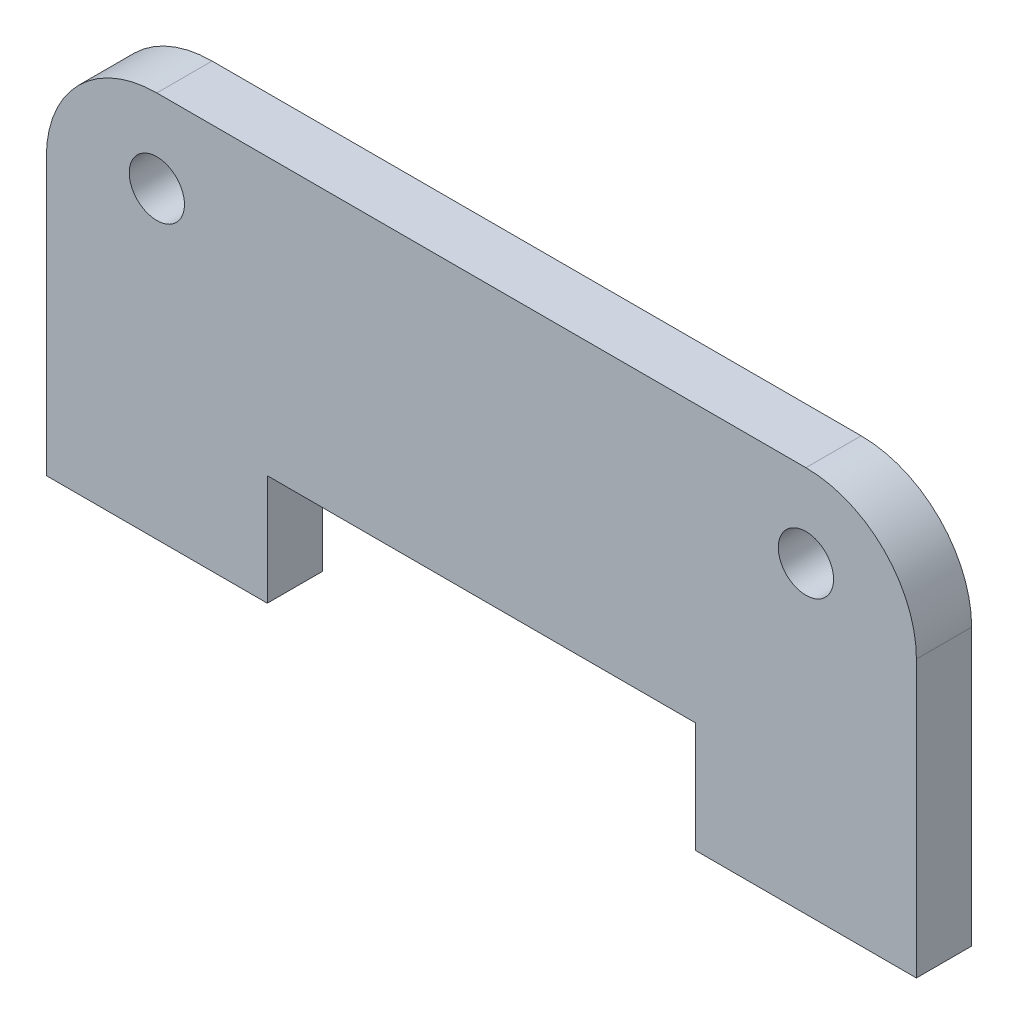
ISO-10303-21;
HEADER;
FILE_DESCRIPTION(('STEP AP214'),'2;1');
FILE_NAME('part.step','',(''),(''),'','','');
FILE_SCHEMA(('AUTOMOTIVE_DESIGN { 1 0 10303 214 1 1 1 1 }'));
ENDSEC;
DATA;
#1=APPLICATION_CONTEXT('core data for automotive mechanical design processes');
#2=APPLICATION_PROTOCOL_DEFINITION('international standard','automotive_design',2000,#1);
#3=PRODUCT_CONTEXT('',#1,'mechanical');
#4=PRODUCT('Part','Part','',(#3));
#5=PRODUCT_RELATED_PRODUCT_CATEGORY('part','',(#4));
#6=PRODUCT_DEFINITION_FORMATION('','',#4);
#7=PRODUCT_DEFINITION_CONTEXT('part definition',#1,'design');
#8=PRODUCT_DEFINITION('design','',#6,#7);
#9=PRODUCT_DEFINITION_SHAPE('','',#8);
#10=(LENGTH_UNIT() NAMED_UNIT(*) SI_UNIT(.MILLI.,.METRE.));
#11=(NAMED_UNIT(*) PLANE_ANGLE_UNIT() SI_UNIT($,.RADIAN.));
#12=(NAMED_UNIT(*) SI_UNIT($,.STERADIAN.) SOLID_ANGLE_UNIT());
#13=UNCERTAINTY_MEASURE_WITH_UNIT(LENGTH_MEASURE(1.E-05),#10,'distance_accuracy_value','');
#14=(GEOMETRIC_REPRESENTATION_CONTEXT(3) GLOBAL_UNCERTAINTY_ASSIGNED_CONTEXT((#13)) GLOBAL_UNIT_ASSIGNED_CONTEXT((#10,
#11,#12)) REPRESENTATION_CONTEXT('',''));
#15=CARTESIAN_POINT('',(0.,0.,0.));
#16=DIRECTION('',(0.,0.,1.));
#17=DIRECTION('',(1.,0.,0.));
#18=AXIS2_PLACEMENT_3D('',#15,#16,#17);
#19=CARTESIAN_POINT('',(-11.75,-1.,2.));
#20=DIRECTION('',(0.,0.,1.));
#21=DIRECTION('',(1.,0.,0.));
#22=AXIS2_PLACEMENT_3D('',#19,#20,#21);
#23=PLANE('',#22);
#24=CARTESIAN_POINT('',(-11.75,0.,2.));
#25=DIRECTION('',(0.,0.,1.));
#26=DIRECTION('',(1.,0.,0.));
#27=AXIS2_PLACEMENT_3D('',#24,#25,#26);
#28=CIRCLE('',#27,0.999999999999998);
#29=CARTESIAN_POINT('',(-10.75,0.,2.));
#30=VERTEX_POINT('',#29);
#31=EDGE_CURVE('E145',#30,#30,#28,.T.);
#32=ORIENTED_EDGE('',*,*,#31,.F.);
#33=EDGE_LOOP('',(#32));
#34=FACE_BOUND('',#33,.T.);
#35=DIRECTION('',(0.,1.,0.));
#36=VECTOR('',#35,1.);
#37=CARTESIAN_POINT('',(15.75,-7.,2.));
#38=LINE('',#37,#36);
#39=CARTESIAN_POINT('',(15.75,-11.,2.));
#40=VERTEX_POINT('',#39);
#41=CARTESIAN_POINT('',(15.75,-1.,2.));
#42=VERTEX_POINT('',#41);
#43=EDGE_CURVE('E99',#40,#42,#38,.T.);
#44=ORIENTED_EDGE('',*,*,#43,.T.);
#45=CARTESIAN_POINT('',(11.75,-1.,2.));
#46=DIRECTION('',(0.,0.,1.));
#47=DIRECTION('',(1.,0.,0.));
#48=AXIS2_PLACEMENT_3D('',#45,#46,#47);
#49=CIRCLE('',#48,4.);
#50=CARTESIAN_POINT('',(11.75,3.,2.));
#51=VERTEX_POINT('',#50);
#52=EDGE_CURVE('E208',#42,#51,#49,.T.);
#53=ORIENTED_EDGE('',*,*,#52,.T.);
#54=DIRECTION('',(-1.,0.,0.));
#55=VECTOR('',#54,1.);
#56=CARTESIAN_POINT('',(-11.75,3.,2.));
#57=LINE('',#56,#55);
#58=CARTESIAN_POINT('',(-11.75,3.,2.));
#59=VERTEX_POINT('',#58);
#60=EDGE_CURVE('E184',#51,#59,#57,.T.);
#61=ORIENTED_EDGE('',*,*,#60,.T.);
#62=CARTESIAN_POINT('',(-11.75,-1.,2.));
#63=DIRECTION('',(0.,0.,1.));
#64=DIRECTION('',(1.,0.,0.));
#65=AXIS2_PLACEMENT_3D('',#62,#63,#64);
#66=CIRCLE('',#65,4.);
#67=CARTESIAN_POINT('',(-15.75,-1.,2.));
#68=VERTEX_POINT('',#67);
#69=EDGE_CURVE('E202',#59,#68,#66,.T.);
#70=ORIENTED_EDGE('',*,*,#69,.T.);
#71=DIRECTION('',(0.,-1.,0.));
#72=VECTOR('',#71,1.);
#73=CARTESIAN_POINT('',(-15.75,-1.,2.));
#74=LINE('',#73,#72);
#75=CARTESIAN_POINT('',(-15.75,-11.,2.));
#76=VERTEX_POINT('',#75);
#77=EDGE_CURVE('E199',#68,#76,#74,.T.);
#78=ORIENTED_EDGE('',*,*,#77,.T.);
#79=DIRECTION('',(1.,0.,0.));
#80=VECTOR('',#79,1.);
#81=CARTESIAN_POINT('',(-15.75,-11.,2.));
#82=LINE('',#81,#80);
#83=CARTESIAN_POINT('',(-7.75,-11.,2.));
#84=VERTEX_POINT('',#83);
#85=EDGE_CURVE('E201',#76,#84,#82,.T.);
#86=ORIENTED_EDGE('',*,*,#85,.T.);
#87=DIRECTION('',(0.,1.,0.));
#88=VECTOR('',#87,1.);
#89=CARTESIAN_POINT('',(-7.75,-11.,2.));
#90=LINE('',#89,#88);
#91=CARTESIAN_POINT('',(-7.75,-7.,2.));
#92=VERTEX_POINT('',#91);
#93=EDGE_CURVE('E125',#84,#92,#90,.T.);
#94=ORIENTED_EDGE('',*,*,#93,.T.);
#95=DIRECTION('',(1.,0.,0.));
#96=VECTOR('',#95,1.);
#97=CARTESIAN_POINT('',(-7.75,-7.,2.));
#98=LINE('',#97,#96);
#99=CARTESIAN_POINT('',(7.75,-7.,2.));
#100=VERTEX_POINT('',#99);
#101=EDGE_CURVE('E119',#92,#100,#98,.T.);
#102=ORIENTED_EDGE('',*,*,#101,.T.);
#103=DIRECTION('',(0.,-1.,0.));
#104=VECTOR('',#103,1.);
#105=CARTESIAN_POINT('',(7.75,-11.,2.));
#106=LINE('',#105,#104);
#107=CARTESIAN_POINT('',(7.75,-11.,2.));
#108=VERTEX_POINT('',#107);
#109=EDGE_CURVE('E123',#100,#108,#106,.T.);
#110=ORIENTED_EDGE('',*,*,#109,.T.);
#111=DIRECTION('',(1.,0.,0.));
#112=VECTOR('',#111,1.);
#113=CARTESIAN_POINT('',(15.75,-11.,2.));
#114=LINE('',#113,#112);
#115=EDGE_CURVE('E51',#108,#40,#114,.T.);
#116=ORIENTED_EDGE('',*,*,#115,.T.);
#117=EDGE_LOOP('',(#44,#53,#61,#70,#78,#86,#94,#102,#110,#116));
#118=FACE_BOUND('',#117,.T.);
#119=CARTESIAN_POINT('',(11.75,0.,2.));
#120=DIRECTION('',(0.,0.,1.));
#121=DIRECTION('',(1.,0.,0.));
#122=AXIS2_PLACEMENT_3D('',#119,#120,#121);
#123=CIRCLE('',#122,1.);
#124=CARTESIAN_POINT('',(12.75,0.,2.));
#125=VERTEX_POINT('',#124);
#126=EDGE_CURVE('E214',#125,#125,#123,.T.);
#127=ORIENTED_EDGE('',*,*,#126,.F.);
#128=EDGE_LOOP('',(#127));
#129=FACE_BOUND('',#128,.T.);
#130=ADVANCED_FACE('F34',(#34,#118,#129),#23,.T.);
#131=CARTESIAN_POINT('',(-11.75,-1.,0.));
#132=DIRECTION('',(0.,0.,1.));
#133=DIRECTION('',(1.,0.,0.));
#134=AXIS2_PLACEMENT_3D('',#131,#132,#133);
#135=PLANE('',#134);
#136=CARTESIAN_POINT('',(-11.75,0.,0.));
#137=DIRECTION('',(0.,0.,1.));
#138=DIRECTION('',(1.,0.,0.));
#139=AXIS2_PLACEMENT_3D('',#136,#137,#138);
#140=CIRCLE('',#139,0.999999999999998);
#141=CARTESIAN_POINT('',(-10.75,0.,0.));
#142=VERTEX_POINT('',#141);
#143=EDGE_CURVE('E211',#142,#142,#140,.T.);
#144=ORIENTED_EDGE('',*,*,#143,.T.);
#145=EDGE_LOOP('',(#144));
#146=FACE_BOUND('',#145,.T.);
#147=DIRECTION('',(0.,1.,0.));
#148=VECTOR('',#147,1.);
#149=CARTESIAN_POINT('',(15.75,-1.,0.));
#150=LINE('',#149,#148);
#151=CARTESIAN_POINT('',(15.75,-11.,0.));
#152=VERTEX_POINT('',#151);
#153=CARTESIAN_POINT('',(15.75,-1.,0.));
#154=VERTEX_POINT('',#153);
#155=EDGE_CURVE('E93',#152,#154,#150,.T.);
#156=ORIENTED_EDGE('',*,*,#155,.F.);
#157=DIRECTION('',(1.,0.,0.));
#158=VECTOR('',#157,1.);
#159=CARTESIAN_POINT('',(15.75,-11.,0.));
#160=LINE('',#159,#158);
#161=CARTESIAN_POINT('',(7.75,-11.,0.));
#162=VERTEX_POINT('',#161);
#163=EDGE_CURVE('E160',#162,#152,#160,.T.);
#164=ORIENTED_EDGE('',*,*,#163,.F.);
#165=DIRECTION('',(0.,-1.,0.));
#166=VECTOR('',#165,1.);
#167=CARTESIAN_POINT('',(7.75,-11.,0.));
#168=LINE('',#167,#166);
#169=CARTESIAN_POINT('',(7.75,-7.,0.));
#170=VERTEX_POINT('',#169);
#171=EDGE_CURVE('E86',#170,#162,#168,.T.);
#172=ORIENTED_EDGE('',*,*,#171,.F.);
#173=DIRECTION('',(1.,0.,0.));
#174=VECTOR('',#173,1.);
#175=CARTESIAN_POINT('',(-7.75,-7.,0.));
#176=LINE('',#175,#174);
#177=CARTESIAN_POINT('',(-7.75,-7.,0.));
#178=VERTEX_POINT('',#177);
#179=EDGE_CURVE('E133',#178,#170,#176,.T.);
#180=ORIENTED_EDGE('',*,*,#179,.F.);
#181=DIRECTION('',(0.,1.,0.));
#182=VECTOR('',#181,1.);
#183=CARTESIAN_POINT('',(-7.75,-11.,0.));
#184=LINE('',#183,#182);
#185=CARTESIAN_POINT('',(-7.75,-11.,0.));
#186=VERTEX_POINT('',#185);
#187=EDGE_CURVE('E156',#186,#178,#184,.T.);
#188=ORIENTED_EDGE('',*,*,#187,.F.);
#189=DIRECTION('',(1.,0.,0.));
#190=VECTOR('',#189,1.);
#191=CARTESIAN_POINT('',(-15.75,-11.,0.));
#192=LINE('',#191,#190);
#193=CARTESIAN_POINT('',(-15.75,-11.,0.));
#194=VERTEX_POINT('',#193);
#195=EDGE_CURVE('E154',#194,#186,#192,.T.);
#196=ORIENTED_EDGE('',*,*,#195,.F.);
#197=DIRECTION('',(0.,-1.,0.));
#198=VECTOR('',#197,1.);
#199=CARTESIAN_POINT('',(-15.75,-7.,0.));
#200=LINE('',#199,#198);
#201=CARTESIAN_POINT('',(-15.75,-1.,0.));
#202=VERTEX_POINT('',#201);
#203=EDGE_CURVE('E152',#202,#194,#200,.T.);
#204=ORIENTED_EDGE('',*,*,#203,.F.);
#205=CARTESIAN_POINT('',(-11.75,-1.,0.));
#206=DIRECTION('',(0.,0.,1.));
#207=DIRECTION('',(1.,0.,0.));
#208=AXIS2_PLACEMENT_3D('',#205,#206,#207);
#209=CIRCLE('',#208,4.);
#210=CARTESIAN_POINT('',(-11.75,3.,0.));
#211=VERTEX_POINT('',#210);
#212=EDGE_CURVE('E149',#211,#202,#209,.T.);
#213=ORIENTED_EDGE('',*,*,#212,.F.);
#214=DIRECTION('',(-1.,0.,0.));
#215=VECTOR('',#214,1.);
#216=CARTESIAN_POINT('',(-11.75,3.,0.));
#217=LINE('',#216,#215);
#218=CARTESIAN_POINT('',(11.75,3.,0.));
#219=VERTEX_POINT('',#218);
#220=EDGE_CURVE('E147',#219,#211,#217,.T.);
#221=ORIENTED_EDGE('',*,*,#220,.F.);
#222=CARTESIAN_POINT('',(11.75,-1.,0.));
#223=DIRECTION('',(0.,0.,1.));
#224=DIRECTION('',(1.,0.,0.));
#225=AXIS2_PLACEMENT_3D('',#222,#223,#224);
#226=CIRCLE('',#225,4.);
#227=EDGE_CURVE('E144',#154,#219,#226,.T.);
#228=ORIENTED_EDGE('',*,*,#227,.F.);
#229=EDGE_LOOP('',(#156,#164,#172,#180,#188,#196,#204,#213,#221,#228));
#230=FACE_BOUND('',#229,.T.);
#231=CARTESIAN_POINT('',(11.75,0.,0.));
#232=DIRECTION('',(0.,0.,1.));
#233=DIRECTION('',(1.,0.,0.));
#234=AXIS2_PLACEMENT_3D('',#231,#232,#233);
#235=CIRCLE('',#234,1.);
#236=CARTESIAN_POINT('',(12.75,0.,0.));
#237=VERTEX_POINT('',#236);
#238=EDGE_CURVE('E217',#237,#237,#235,.T.);
#239=ORIENTED_EDGE('',*,*,#238,.T.);
#240=EDGE_LOOP('',(#239));
#241=FACE_BOUND('',#240,.T.);
#242=ADVANCED_FACE('F188',(#146,#230,#241),#135,.F.);
#243=CARTESIAN_POINT('',(15.75,-1.,2.));
#244=DIRECTION('',(-1.,0.,0.));
#245=DIRECTION('',(0.,0.,1.));
#246=AXIS2_PLACEMENT_3D('',#243,#244,#245);
#247=PLANE('',#246);
#248=ORIENTED_EDGE('',*,*,#155,.T.);
#249=DIRECTION('',(0.,0.,-1.));
#250=VECTOR('',#249,1.);
#251=CARTESIAN_POINT('',(15.75,-1.,2.));
#252=LINE('',#251,#250);
#253=EDGE_CURVE('E11',#42,#154,#252,.T.);
#254=ORIENTED_EDGE('',*,*,#253,.F.);
#255=ORIENTED_EDGE('',*,*,#43,.F.);
#256=DIRECTION('',(0.,0.,-1.));
#257=VECTOR('',#256,1.);
#258=CARTESIAN_POINT('',(15.75,-11.,2.));
#259=LINE('',#258,#257);
#260=EDGE_CURVE('E139',#40,#152,#259,.T.);
#261=ORIENTED_EDGE('',*,*,#260,.T.);
#262=EDGE_LOOP('',(#248,#254,#255,#261));
#263=FACE_BOUND('',#262,.T.);
#264=ADVANCED_FACE('F36',(#263),#247,.F.);
#265=CARTESIAN_POINT('',(11.75,-1.,2.));
#266=DIRECTION('',(0.,0.,-1.));
#267=DIRECTION('',(-1.,0.,0.));
#268=AXIS2_PLACEMENT_3D('',#265,#266,#267);
#269=CYLINDRICAL_SURFACE('',#268,4.);
#270=ORIENTED_EDGE('',*,*,#227,.T.);
#271=DIRECTION('',(0.,0.,-1.));
#272=VECTOR('',#271,1.);
#273=CARTESIAN_POINT('',(11.75,3.,2.));
#274=LINE('',#273,#272);
#275=EDGE_CURVE('E43',#51,#219,#274,.T.);
#276=ORIENTED_EDGE('',*,*,#275,.F.);
#277=ORIENTED_EDGE('',*,*,#52,.F.);
#278=ORIENTED_EDGE('',*,*,#253,.T.);
#279=EDGE_LOOP('',(#270,#276,#277,#278));
#280=FACE_BOUND('',#279,.T.);
#281=ADVANCED_FACE('F259',(#280),#269,.T.);
#282=CARTESIAN_POINT('',(-11.75,3.,2.));
#283=DIRECTION('',(0.,-1.,0.));
#284=DIRECTION('',(0.,0.,-1.));
#285=AXIS2_PLACEMENT_3D('',#282,#283,#284);
#286=PLANE('',#285);
#287=ORIENTED_EDGE('',*,*,#220,.T.);
#288=DIRECTION('',(0.,0.,-1.));
#289=VECTOR('',#288,1.);
#290=CARTESIAN_POINT('',(-11.75,3.,2.));
#291=LINE('',#290,#289);
#292=EDGE_CURVE('E175',#59,#211,#291,.T.);
#293=ORIENTED_EDGE('',*,*,#292,.F.);
#294=ORIENTED_EDGE('',*,*,#60,.F.);
#295=ORIENTED_EDGE('',*,*,#275,.T.);
#296=EDGE_LOOP('',(#287,#293,#294,#295));
#297=FACE_BOUND('',#296,.T.);
#298=ADVANCED_FACE('F182',(#297),#286,.F.);
#299=CARTESIAN_POINT('',(-11.75,-1.,2.));
#300=DIRECTION('',(0.,0.,-1.));
#301=DIRECTION('',(-1.,0.,0.));
#302=AXIS2_PLACEMENT_3D('',#299,#300,#301);
#303=CYLINDRICAL_SURFACE('',#302,4.);
#304=ORIENTED_EDGE('',*,*,#212,.T.);
#305=DIRECTION('',(0.,0.,-1.));
#306=VECTOR('',#305,1.);
#307=CARTESIAN_POINT('',(-15.75,-1.,2.));
#308=LINE('',#307,#306);
#309=EDGE_CURVE('E172',#68,#202,#308,.T.);
#310=ORIENTED_EDGE('',*,*,#309,.F.);
#311=ORIENTED_EDGE('',*,*,#69,.F.);
#312=ORIENTED_EDGE('',*,*,#292,.T.);
#313=EDGE_LOOP('',(#304,#310,#311,#312));
#314=FACE_BOUND('',#313,.T.);
#315=ADVANCED_FACE('F193',(#314),#303,.T.);
#316=CARTESIAN_POINT('',(-15.75,-7.,2.));
#317=DIRECTION('',(1.,0.,0.));
#318=DIRECTION('',(0.,0.,-1.));
#319=AXIS2_PLACEMENT_3D('',#316,#317,#318);
#320=PLANE('',#319);
#321=ORIENTED_EDGE('',*,*,#203,.T.);
#322=DIRECTION('',(0.,0.,-1.));
#323=VECTOR('',#322,1.);
#324=CARTESIAN_POINT('',(-15.75,-11.,2.));
#325=LINE('',#324,#323);
#326=EDGE_CURVE('E169',#76,#194,#325,.T.);
#327=ORIENTED_EDGE('',*,*,#326,.F.);
#328=ORIENTED_EDGE('',*,*,#77,.F.);
#329=ORIENTED_EDGE('',*,*,#309,.T.);
#330=EDGE_LOOP('',(#321,#327,#328,#329));
#331=FACE_BOUND('',#330,.T.);
#332=ADVANCED_FACE('F197',(#331),#320,.F.);
#333=CARTESIAN_POINT('',(-15.75,-11.,2.));
#334=DIRECTION('',(0.,1.,0.));
#335=DIRECTION('',(0.,0.,1.));
#336=AXIS2_PLACEMENT_3D('',#333,#334,#335);
#337=PLANE('',#336);
#338=ORIENTED_EDGE('',*,*,#195,.T.);
#339=DIRECTION('',(0.,0.,-1.));
#340=VECTOR('',#339,1.);
#341=CARTESIAN_POINT('',(-7.75,-11.,2.));
#342=LINE('',#341,#340);
#343=EDGE_CURVE('E166',#84,#186,#342,.T.);
#344=ORIENTED_EDGE('',*,*,#343,.F.);
#345=ORIENTED_EDGE('',*,*,#85,.F.);
#346=ORIENTED_EDGE('',*,*,#326,.T.);
#347=EDGE_LOOP('',(#338,#344,#345,#346));
#348=FACE_BOUND('',#347,.T.);
#349=ADVANCED_FACE('F249',(#348),#337,.F.);
#350=CARTESIAN_POINT('',(-7.75,-11.,2.));
#351=DIRECTION('',(-1.,0.,0.));
#352=DIRECTION('',(0.,0.,1.));
#353=AXIS2_PLACEMENT_3D('',#350,#351,#352);
#354=PLANE('',#353);
#355=ORIENTED_EDGE('',*,*,#187,.T.);
#356=DIRECTION('',(0.,0.,-1.));
#357=VECTOR('',#356,1.);
#358=CARTESIAN_POINT('',(-7.75,-7.,2.));
#359=LINE('',#358,#357);
#360=EDGE_CURVE('E134',#92,#178,#359,.T.);
#361=ORIENTED_EDGE('',*,*,#360,.F.);
#362=ORIENTED_EDGE('',*,*,#93,.F.);
#363=ORIENTED_EDGE('',*,*,#343,.T.);
#364=EDGE_LOOP('',(#355,#361,#362,#363));
#365=FACE_BOUND('',#364,.T.);
#366=ADVANCED_FACE('F246',(#365),#354,.F.);
#367=CARTESIAN_POINT('',(-7.75,-7.,2.));
#368=DIRECTION('',(0.,1.,0.));
#369=DIRECTION('',(0.,0.,1.));
#370=AXIS2_PLACEMENT_3D('',#367,#368,#369);
#371=PLANE('',#370);
#372=ORIENTED_EDGE('',*,*,#179,.T.);
#373=DIRECTION('',(0.,0.,-1.));
#374=VECTOR('',#373,1.);
#375=CARTESIAN_POINT('',(7.75,-7.,2.));
#376=LINE('',#375,#374);
#377=EDGE_CURVE('E130',#100,#170,#376,.T.);
#378=ORIENTED_EDGE('',*,*,#377,.F.);
#379=ORIENTED_EDGE('',*,*,#101,.F.);
#380=ORIENTED_EDGE('',*,*,#360,.T.);
#381=EDGE_LOOP('',(#372,#378,#379,#380));
#382=FACE_BOUND('',#381,.T.);
#383=ADVANCED_FACE('F131',(#382),#371,.F.);
#384=CARTESIAN_POINT('',(7.75,-11.,2.));
#385=DIRECTION('',(1.,0.,0.));
#386=DIRECTION('',(0.,0.,-1.));
#387=AXIS2_PLACEMENT_3D('',#384,#385,#386);
#388=PLANE('',#387);
#389=ORIENTED_EDGE('',*,*,#171,.T.);
#390=DIRECTION('',(0.,0.,-1.));
#391=VECTOR('',#390,1.);
#392=CARTESIAN_POINT('',(7.75,-11.,2.));
#393=LINE('',#392,#391);
#394=EDGE_CURVE('E135',#108,#162,#393,.T.);
#395=ORIENTED_EDGE('',*,*,#394,.F.);
#396=ORIENTED_EDGE('',*,*,#109,.F.);
#397=ORIENTED_EDGE('',*,*,#377,.T.);
#398=EDGE_LOOP('',(#389,#395,#396,#397));
#399=FACE_BOUND('',#398,.T.);
#400=ADVANCED_FACE('F137',(#399),#388,.F.);
#401=CARTESIAN_POINT('',(15.75,-11.,2.));
#402=DIRECTION('',(0.,1.,0.));
#403=DIRECTION('',(0.,0.,1.));
#404=AXIS2_PLACEMENT_3D('',#401,#402,#403);
#405=PLANE('',#404);
#406=ORIENTED_EDGE('',*,*,#163,.T.);
#407=ORIENTED_EDGE('',*,*,#260,.F.);
#408=ORIENTED_EDGE('',*,*,#115,.F.);
#409=ORIENTED_EDGE('',*,*,#394,.T.);
#410=EDGE_LOOP('',(#406,#407,#408,#409));
#411=FACE_BOUND('',#410,.T.);
#412=ADVANCED_FACE('F238',(#411),#405,.F.);
#413=CARTESIAN_POINT('',(-11.75,0.,2.));
#414=DIRECTION('',(0.,0.,-1.));
#415=DIRECTION('',(-1.,0.,0.));
#416=AXIS2_PLACEMENT_3D('',#413,#414,#415);
#417=CYLINDRICAL_SURFACE('',#416,0.999999999999998);
#418=ORIENTED_EDGE('',*,*,#31,.T.);
#419=EDGE_LOOP('',(#418));
#420=FACE_BOUND('',#419,.T.);
#421=ORIENTED_EDGE('',*,*,#143,.F.);
#422=EDGE_LOOP('',(#421));
#423=FACE_BOUND('',#422,.T.);
#424=ADVANCED_FACE('F235',(#420,#423),#417,.F.);
#425=CARTESIAN_POINT('',(11.75,0.,2.));
#426=DIRECTION('',(0.,0.,-1.));
#427=DIRECTION('',(-1.,0.,0.));
#428=AXIS2_PLACEMENT_3D('',#425,#426,#427);
#429=CYLINDRICAL_SURFACE('',#428,1.);
#430=ORIENTED_EDGE('',*,*,#126,.T.);
#431=EDGE_LOOP('',(#430));
#432=FACE_BOUND('',#431,.T.);
#433=ORIENTED_EDGE('',*,*,#238,.F.);
#434=EDGE_LOOP('',(#433));
#435=FACE_BOUND('',#434,.T.);
#436=ADVANCED_FACE('F223',(#432,#435),#429,.F.);
#437=CLOSED_SHELL('',(#130,#242,#264,#281,#298,#315,#332,#349,#366,#383,#400,#412,#424,#436));
#438=MANIFOLD_SOLID_BREP('B2',#437);
#439=ADVANCED_BREP_SHAPE_REPRESENTATION('',(#18,#438),#14);
#440=SHAPE_DEFINITION_REPRESENTATION(#9,#439);
ENDSEC;
END-ISO-10303-21;
